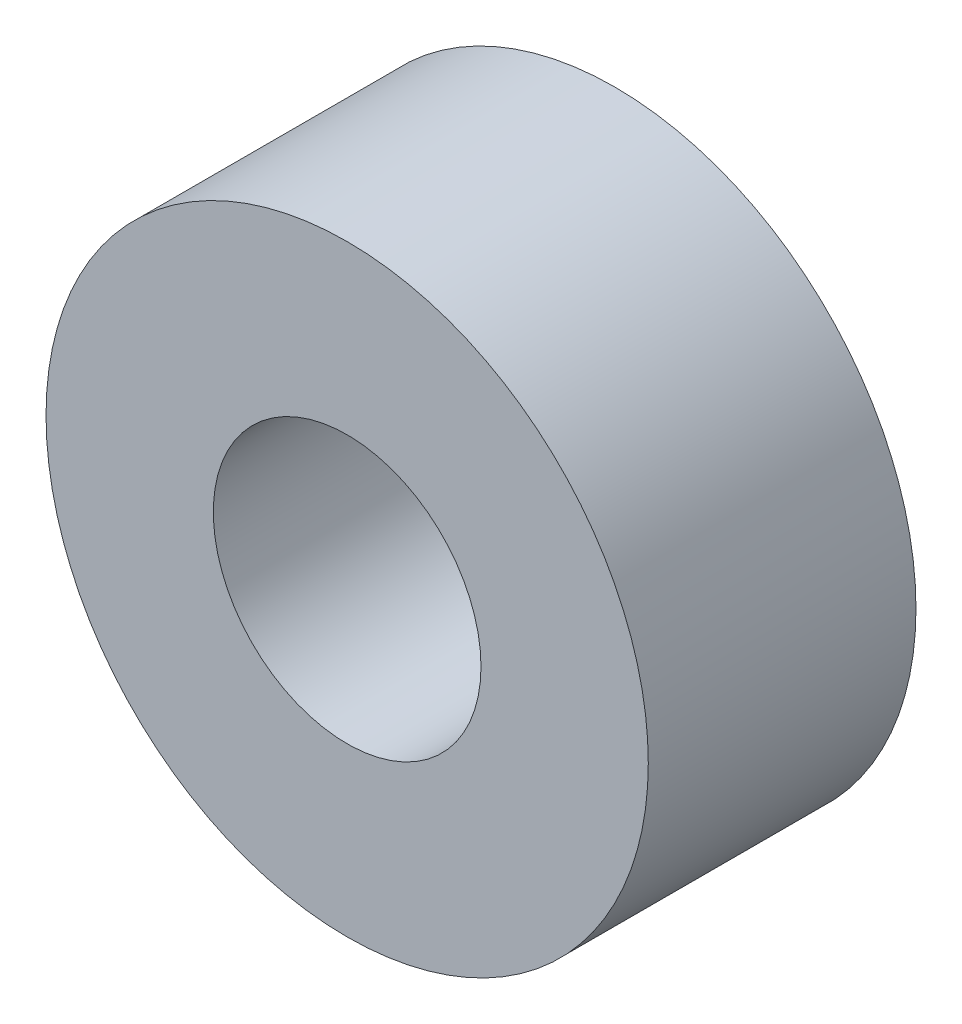
ISO-10303-21;
HEADER;
FILE_DESCRIPTION(('STEP AP214'),'2;1');
FILE_NAME('part.step','',(''),(''),'','','');
FILE_SCHEMA(('AUTOMOTIVE_DESIGN { 1 0 10303 214 1 1 1 1 }'));
ENDSEC;
DATA;
#1=APPLICATION_CONTEXT('core data for automotive mechanical design processes');
#2=APPLICATION_PROTOCOL_DEFINITION('international standard','automotive_design',2000,#1);
#3=PRODUCT_CONTEXT('',#1,'mechanical');
#4=PRODUCT('Part','Part','',(#3));
#5=PRODUCT_RELATED_PRODUCT_CATEGORY('part','',(#4));
#6=PRODUCT_DEFINITION_FORMATION('','',#4);
#7=PRODUCT_DEFINITION_CONTEXT('part definition',#1,'design');
#8=PRODUCT_DEFINITION('design','',#6,#7);
#9=PRODUCT_DEFINITION_SHAPE('','',#8);
#10=(LENGTH_UNIT() NAMED_UNIT(*) SI_UNIT(.MILLI.,.METRE.));
#11=(NAMED_UNIT(*) PLANE_ANGLE_UNIT() SI_UNIT($,.RADIAN.));
#12=(NAMED_UNIT(*) SI_UNIT($,.STERADIAN.) SOLID_ANGLE_UNIT());
#13=UNCERTAINTY_MEASURE_WITH_UNIT(LENGTH_MEASURE(1.E-05),#10,'distance_accuracy_value','');
#14=(GEOMETRIC_REPRESENTATION_CONTEXT(3) GLOBAL_UNCERTAINTY_ASSIGNED_CONTEXT((#13)) GLOBAL_UNIT_ASSIGNED_CONTEXT((#10,
#11,#12)) REPRESENTATION_CONTEXT('',''));
#15=CARTESIAN_POINT('',(0.,0.,0.));
#16=DIRECTION('',(0.,0.,1.));
#17=DIRECTION('',(1.,0.,0.));
#18=AXIS2_PLACEMENT_3D('',#15,#16,#17);
#19=CARTESIAN_POINT('',(0.,0.,4.));
#20=DIRECTION('',(0.,0.,1.));
#21=DIRECTION('',(1.,0.,0.));
#22=AXIS2_PLACEMENT_3D('',#19,#20,#21);
#23=PLANE('',#22);
#24=CARTESIAN_POINT('',(0.,0.,4.));
#25=DIRECTION('',(0.,0.,1.));
#26=DIRECTION('',(1.,0.,0.));
#27=AXIS2_PLACEMENT_3D('',#24,#25,#26);
#28=CIRCLE('',#27,4.5);
#29=CARTESIAN_POINT('',(4.5,0.,4.));
#30=VERTEX_POINT('',#29);
#31=EDGE_CURVE('E10',#30,#30,#28,.T.);
#32=ORIENTED_EDGE('',*,*,#31,.T.);
#33=EDGE_LOOP('',(#32));
#34=FACE_BOUND('',#33,.T.);
#35=CARTESIAN_POINT('',(0.,0.,4.));
#36=DIRECTION('',(0.,0.,1.));
#37=DIRECTION('',(1.,0.,0.));
#38=AXIS2_PLACEMENT_3D('',#35,#36,#37);
#39=CIRCLE('',#38,2.);
#40=CARTESIAN_POINT('',(2.,0.,4.));
#41=VERTEX_POINT('',#40);
#42=EDGE_CURVE('E43',#41,#41,#39,.T.);
#43=ORIENTED_EDGE('',*,*,#42,.F.);
#44=EDGE_LOOP('',(#43));
#45=FACE_BOUND('',#44,.T.);
#46=ADVANCED_FACE('F32',(#34,#45),#23,.T.);
#47=CARTESIAN_POINT('',(0.,0.,0.));
#48=DIRECTION('',(0.,0.,1.));
#49=DIRECTION('',(1.,0.,0.));
#50=AXIS2_PLACEMENT_3D('',#47,#48,#49);
#51=PLANE('',#50);
#52=CARTESIAN_POINT('',(0.,0.,0.));
#53=DIRECTION('',(0.,0.,1.));
#54=DIRECTION('',(1.,0.,0.));
#55=AXIS2_PLACEMENT_3D('',#52,#53,#54);
#56=CIRCLE('',#55,4.5);
#57=CARTESIAN_POINT('',(4.5,0.,0.));
#58=VERTEX_POINT('',#57);
#59=EDGE_CURVE('E36',#58,#58,#56,.T.);
#60=ORIENTED_EDGE('',*,*,#59,.F.);
#61=EDGE_LOOP('',(#60));
#62=FACE_BOUND('',#61,.T.);
#63=CARTESIAN_POINT('',(0.,0.,0.));
#64=DIRECTION('',(0.,0.,1.));
#65=DIRECTION('',(1.,0.,0.));
#66=AXIS2_PLACEMENT_3D('',#63,#64,#65);
#67=CIRCLE('',#66,2.);
#68=CARTESIAN_POINT('',(2.,0.,0.));
#69=VERTEX_POINT('',#68);
#70=EDGE_CURVE('E45',#69,#69,#67,.T.);
#71=ORIENTED_EDGE('',*,*,#70,.T.);
#72=EDGE_LOOP('',(#71));
#73=FACE_BOUND('',#72,.T.);
#74=ADVANCED_FACE('F55',(#62,#73),#51,.F.);
#75=CARTESIAN_POINT('',(0.,0.,4.));
#76=DIRECTION('',(0.,0.,-1.));
#77=DIRECTION('',(-1.,0.,0.));
#78=AXIS2_PLACEMENT_3D('',#75,#76,#77);
#79=CYLINDRICAL_SURFACE('',#78,4.5);
#80=ORIENTED_EDGE('',*,*,#31,.F.);
#81=EDGE_LOOP('',(#80));
#82=FACE_BOUND('',#81,.T.);
#83=ORIENTED_EDGE('',*,*,#59,.T.);
#84=EDGE_LOOP('',(#83));
#85=FACE_BOUND('',#84,.T.);
#86=ADVANCED_FACE('F34',(#82,#85),#79,.T.);
#87=CARTESIAN_POINT('',(0.,0.,4.));
#88=DIRECTION('',(0.,0.,-1.));
#89=DIRECTION('',(-1.,0.,0.));
#90=AXIS2_PLACEMENT_3D('',#87,#88,#89);
#91=CYLINDRICAL_SURFACE('',#90,2.);
#92=ORIENTED_EDGE('',*,*,#42,.T.);
#93=EDGE_LOOP('',(#92));
#94=FACE_BOUND('',#93,.T.);
#95=ORIENTED_EDGE('',*,*,#70,.F.);
#96=EDGE_LOOP('',(#95));
#97=FACE_BOUND('',#96,.T.);
#98=ADVANCED_FACE('F51',(#94,#97),#91,.F.);
#99=CLOSED_SHELL('',(#46,#74,#86,#98));
#100=MANIFOLD_SOLID_BREP('B2',#99);
#101=ADVANCED_BREP_SHAPE_REPRESENTATION('',(#18,#100),#14);
#102=SHAPE_DEFINITION_REPRESENTATION(#9,#101);
ENDSEC;
END-ISO-10303-21;
